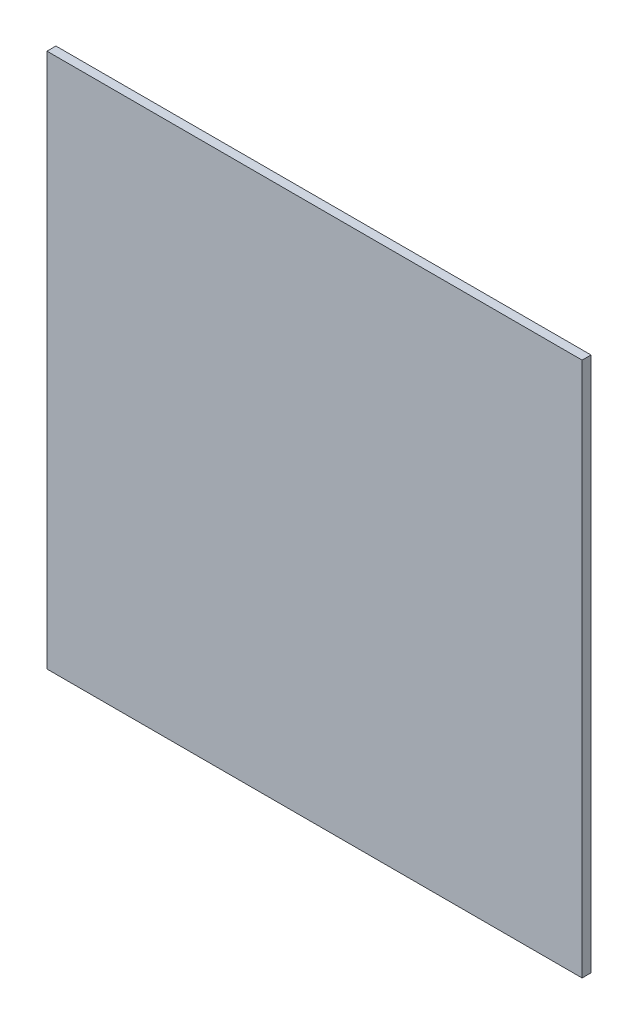
ISO-10303-21;
HEADER;
FILE_DESCRIPTION(('STEP AP214'),'2;1');
FILE_NAME('part.step','',(''),(''),'','','');
FILE_SCHEMA(('AUTOMOTIVE_DESIGN { 1 0 10303 214 1 1 1 1 }'));
ENDSEC;
DATA;
#1=APPLICATION_CONTEXT('core data for automotive mechanical design processes');
#2=APPLICATION_PROTOCOL_DEFINITION('international standard','automotive_design',2000,#1);
#3=PRODUCT_CONTEXT('',#1,'mechanical');
#4=PRODUCT('Part','Part','',(#3));
#5=PRODUCT_RELATED_PRODUCT_CATEGORY('part','',(#4));
#6=PRODUCT_DEFINITION_FORMATION('','',#4);
#7=PRODUCT_DEFINITION_CONTEXT('part definition',#1,'design');
#8=PRODUCT_DEFINITION('design','',#6,#7);
#9=PRODUCT_DEFINITION_SHAPE('','',#8);
#10=(LENGTH_UNIT() NAMED_UNIT(*) SI_UNIT(.MILLI.,.METRE.));
#11=(NAMED_UNIT(*) PLANE_ANGLE_UNIT() SI_UNIT($,.RADIAN.));
#12=(NAMED_UNIT(*) SI_UNIT($,.STERADIAN.) SOLID_ANGLE_UNIT());
#13=UNCERTAINTY_MEASURE_WITH_UNIT(LENGTH_MEASURE(1.E-05),#10,'distance_accuracy_value','');
#14=(GEOMETRIC_REPRESENTATION_CONTEXT(3) GLOBAL_UNCERTAINTY_ASSIGNED_CONTEXT((#13)) GLOBAL_UNIT_ASSIGNED_CONTEXT((#10,
#11,#12)) REPRESENTATION_CONTEXT('',''));
#15=CARTESIAN_POINT('',(0.,0.,0.));
#16=DIRECTION('',(0.,0.,1.));
#17=DIRECTION('',(1.,0.,0.));
#18=AXIS2_PLACEMENT_3D('',#15,#16,#17);
#19=CARTESIAN_POINT('',(0.,0.,5.));
#20=DIRECTION('',(1.,0.,0.));
#21=DIRECTION('',(0.,0.,-1.));
#22=AXIS2_PLACEMENT_3D('',#19,#20,#21);
#23=PLANE('',#22);
#24=DIRECTION('',(0.,-1.,0.));
#25=VECTOR('',#24,1.);
#26=CARTESIAN_POINT('',(0.,0.,0.));
#27=LINE('',#26,#25);
#28=CARTESIAN_POINT('',(0.,300.,0.));
#29=VERTEX_POINT('',#28);
#30=CARTESIAN_POINT('',(0.,0.,0.));
#31=VERTEX_POINT('',#30);
#32=EDGE_CURVE('E113',#29,#31,#27,.T.);
#33=ORIENTED_EDGE('',*,*,#32,.T.);
#34=DIRECTION('',(0.,0.,-1.));
#35=VECTOR('',#34,1.);
#36=CARTESIAN_POINT('',(0.,0.,5.));
#37=LINE('',#36,#35);
#38=CARTESIAN_POINT('',(0.,0.,5.));
#39=VERTEX_POINT('',#38);
#40=EDGE_CURVE('E11',#39,#31,#37,.T.);
#41=ORIENTED_EDGE('',*,*,#40,.F.);
#42=DIRECTION('',(0.,-1.,0.));
#43=VECTOR('',#42,1.);
#44=CARTESIAN_POINT('',(0.,0.,5.));
#45=LINE('',#44,#43);
#46=CARTESIAN_POINT('',(0.,300.,5.));
#47=VERTEX_POINT('',#46);
#48=EDGE_CURVE('E97',#47,#39,#45,.T.);
#49=ORIENTED_EDGE('',*,*,#48,.F.);
#50=DIRECTION('',(0.,0.,-1.));
#51=VECTOR('',#50,1.);
#52=CARTESIAN_POINT('',(0.,300.,5.));
#53=LINE('',#52,#51);
#54=EDGE_CURVE('E109',#47,#29,#53,.T.);
#55=ORIENTED_EDGE('',*,*,#54,.T.);
#56=EDGE_LOOP('',(#33,#41,#49,#55));
#57=FACE_BOUND('',#56,.T.);
#58=ADVANCED_FACE('F45',(#57),#23,.F.);
#59=CARTESIAN_POINT('',(0.,0.,5.));
#60=DIRECTION('',(0.,1.,0.));
#61=DIRECTION('',(0.,0.,1.));
#62=AXIS2_PLACEMENT_3D('',#59,#60,#61);
#63=PLANE('',#62);
#64=DIRECTION('',(1.,0.,0.));
#65=VECTOR('',#64,1.);
#66=CARTESIAN_POINT('',(0.,0.,0.));
#67=LINE('',#66,#65);
#68=CARTESIAN_POINT('',(300.,0.,0.));
#69=VERTEX_POINT('',#68);
#70=EDGE_CURVE('E102',#31,#69,#67,.T.);
#71=ORIENTED_EDGE('',*,*,#70,.T.);
#72=DIRECTION('',(0.,0.,-1.));
#73=VECTOR('',#72,1.);
#74=CARTESIAN_POINT('',(300.,0.,5.));
#75=LINE('',#74,#73);
#76=CARTESIAN_POINT('',(300.,0.,5.));
#77=VERTEX_POINT('',#76);
#78=EDGE_CURVE('E54',#77,#69,#75,.T.);
#79=ORIENTED_EDGE('',*,*,#78,.F.);
#80=DIRECTION('',(1.,0.,0.));
#81=VECTOR('',#80,1.);
#82=CARTESIAN_POINT('',(0.,0.,5.));
#83=LINE('',#82,#81);
#84=EDGE_CURVE('E92',#39,#77,#83,.T.);
#85=ORIENTED_EDGE('',*,*,#84,.F.);
#86=ORIENTED_EDGE('',*,*,#40,.T.);
#87=EDGE_LOOP('',(#71,#79,#85,#86));
#88=FACE_BOUND('',#87,.T.);
#89=ADVANCED_FACE('F101',(#88),#63,.F.);
#90=CARTESIAN_POINT('',(300.,0.,5.));
#91=DIRECTION('',(-1.,0.,0.));
#92=DIRECTION('',(0.,-1.,0.));
#93=AXIS2_PLACEMENT_3D('',#90,#91,#92);
#94=PLANE('',#93);
#95=DIRECTION('',(0.,1.,0.));
#96=VECTOR('',#95,1.);
#97=CARTESIAN_POINT('',(300.,0.,0.));
#98=LINE('',#97,#96);
#99=CARTESIAN_POINT('',(300.,300.,0.));
#100=VERTEX_POINT('',#99);
#101=EDGE_CURVE('E79',#69,#100,#98,.T.);
#102=ORIENTED_EDGE('',*,*,#101,.T.);
#103=DIRECTION('',(0.,0.,-1.));
#104=VECTOR('',#103,1.);
#105=CARTESIAN_POINT('',(300.,300.,5.));
#106=LINE('',#105,#104);
#107=CARTESIAN_POINT('',(300.,300.,5.));
#108=VERTEX_POINT('',#107);
#109=EDGE_CURVE('E104',#108,#100,#106,.T.);
#110=ORIENTED_EDGE('',*,*,#109,.F.);
#111=DIRECTION('',(0.,1.,0.));
#112=VECTOR('',#111,1.);
#113=CARTESIAN_POINT('',(300.,0.,5.));
#114=LINE('',#113,#112);
#115=EDGE_CURVE('E95',#77,#108,#114,.T.);
#116=ORIENTED_EDGE('',*,*,#115,.F.);
#117=ORIENTED_EDGE('',*,*,#78,.T.);
#118=EDGE_LOOP('',(#102,#110,#116,#117));
#119=FACE_BOUND('',#118,.T.);
#120=ADVANCED_FACE('F105',(#119),#94,.F.);
#121=CARTESIAN_POINT('',(0.,300.,5.));
#122=DIRECTION('',(0.,-1.,0.));
#123=DIRECTION('',(0.,0.,-1.));
#124=AXIS2_PLACEMENT_3D('',#121,#122,#123);
#125=PLANE('',#124);
#126=DIRECTION('',(-1.,0.,0.));
#127=VECTOR('',#126,1.);
#128=CARTESIAN_POINT('',(0.,300.,0.));
#129=LINE('',#128,#127);
#130=EDGE_CURVE('E85',#100,#29,#129,.T.);
#131=ORIENTED_EDGE('',*,*,#130,.T.);
#132=ORIENTED_EDGE('',*,*,#54,.F.);
#133=DIRECTION('',(-1.,0.,0.));
#134=VECTOR('',#133,1.);
#135=CARTESIAN_POINT('',(0.,300.,5.));
#136=LINE('',#135,#134);
#137=EDGE_CURVE('E62',#108,#47,#136,.T.);
#138=ORIENTED_EDGE('',*,*,#137,.F.);
#139=ORIENTED_EDGE('',*,*,#109,.T.);
#140=EDGE_LOOP('',(#131,#132,#138,#139));
#141=FACE_BOUND('',#140,.T.);
#142=ADVANCED_FACE('F126',(#141),#125,.F.);
#143=CARTESIAN_POINT('',(0.,0.,5.));
#144=DIRECTION('',(0.,0.,-1.));
#145=DIRECTION('',(-1.,0.,0.));
#146=AXIS2_PLACEMENT_3D('',#143,#144,#145);
#147=PLANE('',#146);
#148=ORIENTED_EDGE('',*,*,#48,.T.);
#149=ORIENTED_EDGE('',*,*,#84,.T.);
#150=ORIENTED_EDGE('',*,*,#115,.T.);
#151=ORIENTED_EDGE('',*,*,#137,.T.);
#152=EDGE_LOOP('',(#148,#149,#150,#151));
#153=FACE_BOUND('',#152,.T.);
#154=ADVANCED_FACE('F93',(#153),#147,.F.);
#155=CARTESIAN_POINT('',(0.,0.,0.));
#156=DIRECTION('',(0.,0.,-1.));
#157=DIRECTION('',(-1.,0.,0.));
#158=AXIS2_PLACEMENT_3D('',#155,#156,#157);
#159=PLANE('',#158);
#160=ORIENTED_EDGE('',*,*,#32,.F.);
#161=ORIENTED_EDGE('',*,*,#130,.F.);
#162=ORIENTED_EDGE('',*,*,#101,.F.);
#163=ORIENTED_EDGE('',*,*,#70,.F.);
#164=EDGE_LOOP('',(#160,#161,#162,#163));
#165=FACE_BOUND('',#164,.T.);
#166=ADVANCED_FACE('F129',(#165),#159,.T.);
#167=CLOSED_SHELL('',(#58,#89,#120,#142,#154,#166));
#168=MANIFOLD_SOLID_BREP('B2',#167);
#169=ADVANCED_BREP_SHAPE_REPRESENTATION('',(#18,#168),#14);
#170=SHAPE_DEFINITION_REPRESENTATION(#9,#169);
ENDSEC;
END-ISO-10303-21;
